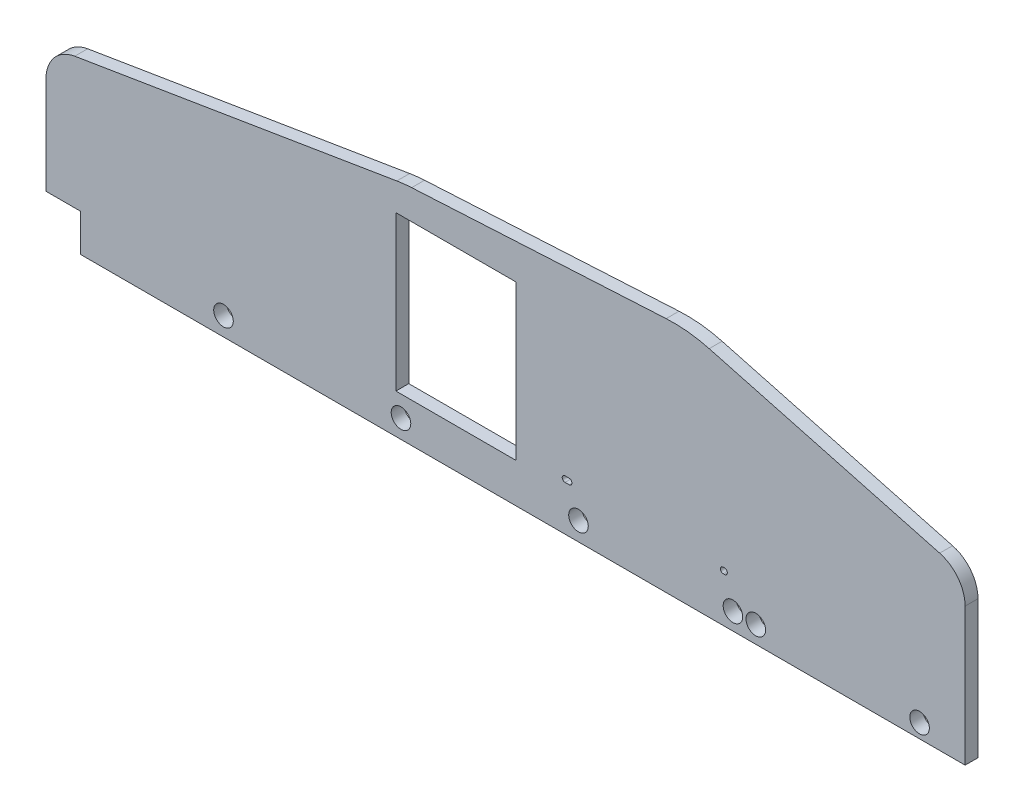
ISO-10303-21;
HEADER;
FILE_DESCRIPTION(('STEP AP214'),'2;1');
FILE_NAME('part.step','',(''),(''),'','','');
FILE_SCHEMA(('AUTOMOTIVE_DESIGN { 1 0 10303 214 1 1 1 1 }'));
ENDSEC;
DATA;
#1=APPLICATION_CONTEXT('core data for automotive mechanical design processes');
#2=APPLICATION_PROTOCOL_DEFINITION('international standard','automotive_design',2000,#1);
#3=PRODUCT_CONTEXT('',#1,'mechanical');
#4=PRODUCT('Part','Part','',(#3));
#5=PRODUCT_RELATED_PRODUCT_CATEGORY('part','',(#4));
#6=PRODUCT_DEFINITION_FORMATION('','',#4);
#7=PRODUCT_DEFINITION_CONTEXT('part definition',#1,'design');
#8=PRODUCT_DEFINITION('design','',#6,#7);
#9=PRODUCT_DEFINITION_SHAPE('','',#8);
#10=(LENGTH_UNIT() NAMED_UNIT(*) SI_UNIT(.MILLI.,.METRE.));
#11=(NAMED_UNIT(*) PLANE_ANGLE_UNIT() SI_UNIT($,.RADIAN.));
#12=(NAMED_UNIT(*) SI_UNIT($,.STERADIAN.) SOLID_ANGLE_UNIT());
#13=UNCERTAINTY_MEASURE_WITH_UNIT(LENGTH_MEASURE(1.E-05),#10,'distance_accuracy_value','');
#14=(GEOMETRIC_REPRESENTATION_CONTEXT(3) GLOBAL_UNCERTAINTY_ASSIGNED_CONTEXT((#13)) GLOBAL_UNIT_ASSIGNED_CONTEXT((#10,
#11,#12)) REPRESENTATION_CONTEXT('',''));
#15=CARTESIAN_POINT('',(0.,0.,0.));
#16=DIRECTION('',(0.,0.,1.));
#17=DIRECTION('',(1.,0.,0.));
#18=AXIS2_PLACEMENT_3D('',#15,#16,#17);
#19=CARTESIAN_POINT('',(0.,0.,4.7625));
#20=DIRECTION('',(0.,0.,1.));
#21=DIRECTION('',(1.,0.,0.));
#22=AXIS2_PLACEMENT_3D('',#19,#20,#21);
#23=PLANE('',#22);
#24=CARTESIAN_POINT('',(46.9999999999997,35.3,4.7625));
#25=DIRECTION('',(0.,0.,1.));
#26=DIRECTION('',(1.,0.,0.));
#27=AXIS2_PLACEMENT_3D('',#24,#25,#26);
#28=CIRCLE('',#27,2.09999999999998);
#29=CARTESIAN_POINT('',(46.9999999999997,33.2,4.7625));
#30=VERTEX_POINT('',#29);
#31=CARTESIAN_POINT('',(46.9999999999997,37.3999999999999,4.7625));
#32=VERTEX_POINT('',#31);
#33=EDGE_CURVE('E50',#30,#32,#28,.T.);
#34=ORIENTED_EDGE('',*,*,#33,.F.);
#35=DIRECTION('',(1.,0.,0.));
#36=VECTOR('',#35,1.);
#37=CARTESIAN_POINT('',(46.9999999999997,33.2,4.7625));
#38=LINE('',#37,#36);
#39=CARTESIAN_POINT('',(43.9999999999997,33.2,4.7625));
#40=VERTEX_POINT('',#39);
#41=EDGE_CURVE('E213',#40,#30,#38,.T.);
#42=ORIENTED_EDGE('',*,*,#41,.F.);
#43=CARTESIAN_POINT('',(43.9999999999997,35.3,4.7625));
#44=DIRECTION('',(0.,0.,1.));
#45=DIRECTION('',(1.,0.,0.));
#46=AXIS2_PLACEMENT_3D('',#43,#44,#45);
#47=CIRCLE('',#46,2.09999999999998);
#48=CARTESIAN_POINT('',(43.9999999999997,37.3999999999999,4.7625));
#49=VERTEX_POINT('',#48);
#50=EDGE_CURVE('E216',#49,#40,#47,.T.);
#51=ORIENTED_EDGE('',*,*,#50,.F.);
#52=DIRECTION('',(-1.,0.,0.));
#53=VECTOR('',#52,1.);
#54=CARTESIAN_POINT('',(46.9999999999997,37.3999999999999,4.7625));
#55=LINE('',#54,#53);
#56=EDGE_CURVE('E222',#32,#49,#55,.T.);
#57=ORIENTED_EDGE('',*,*,#56,.F.);
#58=EDGE_LOOP('',(#34,#42,#51,#57));
#59=FACE_BOUND('',#58,.T.);
#60=CARTESIAN_POINT('',(161.,35.3,4.7625));
#61=DIRECTION('',(0.,0.,1.));
#62=DIRECTION('',(1.,0.,0.));
#63=AXIS2_PLACEMENT_3D('',#60,#61,#62);
#64=CIRCLE('',#63,2.1);
#65=CARTESIAN_POINT('',(161.,37.4,4.7625));
#66=VERTEX_POINT('',#65);
#67=CARTESIAN_POINT('',(161.,33.2,4.7625));
#68=VERTEX_POINT('',#67);
#69=EDGE_CURVE('E228',#66,#68,#64,.T.);
#70=ORIENTED_EDGE('',*,*,#69,.F.);
#71=DIRECTION('',(-1.,0.,0.));
#72=VECTOR('',#71,1.);
#73=CARTESIAN_POINT('',(161.,37.4,4.7625));
#74=LINE('',#73,#72);
#75=CARTESIAN_POINT('',(162.,37.4,4.7625));
#76=VERTEX_POINT('',#75);
#77=EDGE_CURVE('E236',#76,#66,#74,.T.);
#78=ORIENTED_EDGE('',*,*,#77,.F.);
#79=CARTESIAN_POINT('',(162.,35.3,4.7625));
#80=DIRECTION('',(0.,0.,1.));
#81=DIRECTION('',(1.,0.,0.));
#82=AXIS2_PLACEMENT_3D('',#79,#80,#81);
#83=CIRCLE('',#82,2.1);
#84=CARTESIAN_POINT('',(162.,33.2,4.7625));
#85=VERTEX_POINT('',#84);
#86=EDGE_CURVE('E250',#85,#76,#83,.T.);
#87=ORIENTED_EDGE('',*,*,#86,.F.);
#88=DIRECTION('',(1.,0.,0.));
#89=VECTOR('',#88,1.);
#90=CARTESIAN_POINT('',(161.,33.2,4.7625));
#91=LINE('',#90,#89);
#92=EDGE_CURVE('E247',#68,#85,#91,.T.);
#93=ORIENTED_EDGE('',*,*,#92,.F.);
#94=EDGE_LOOP('',(#70,#78,#87,#93));
#95=FACE_BOUND('',#94,.T.);
#96=DIRECTION('',(0.,1.,0.));
#97=VECTOR('',#96,1.);
#98=CARTESIAN_POINT('',(7.78151433000002,29.1464999993336,4.7625));
#99=LINE('',#98,#97);
#100=CARTESIAN_POINT('',(7.78151433000002,29.1464999993336,4.7625));
#101=VERTEX_POINT('',#100);
#102=CARTESIAN_POINT('',(7.78151433000002,143.446499999334,4.7625));
#103=VERTEX_POINT('',#102);
#104=EDGE_CURVE('E257',#101,#103,#99,.T.);
#105=ORIENTED_EDGE('',*,*,#104,.F.);
#106=DIRECTION('',(1.,0.,0.));
#107=VECTOR('',#106,1.);
#108=CARTESIAN_POINT('',(-81.1184856700001,29.1464999993336,4.7625));
#109=LINE('',#108,#107);
#110=CARTESIAN_POINT('',(-81.1184856700001,29.1464999993336,4.7625));
#111=VERTEX_POINT('',#110);
#112=EDGE_CURVE('E268',#111,#101,#109,.T.);
#113=ORIENTED_EDGE('',*,*,#112,.F.);
#114=DIRECTION('',(0.,-1.,0.));
#115=VECTOR('',#114,1.);
#116=CARTESIAN_POINT('',(-81.1184856700001,29.1464999993336,4.7625));
#117=LINE('',#116,#115);
#118=CARTESIAN_POINT('',(-81.1184856700001,143.446499999334,4.7625));
#119=VERTEX_POINT('',#118);
#120=EDGE_CURVE('E282',#119,#111,#117,.T.);
#121=ORIENTED_EDGE('',*,*,#120,.F.);
#122=DIRECTION('',(-1.,0.,0.));
#123=VECTOR('',#122,1.);
#124=CARTESIAN_POINT('',(7.78151433000002,143.446499999334,4.7625));
#125=LINE('',#124,#123);
#126=EDGE_CURVE('E279',#103,#119,#125,.T.);
#127=ORIENTED_EDGE('',*,*,#126,.F.);
#128=EDGE_LOOP('',(#105,#113,#121,#127));
#129=FACE_BOUND('',#128,.T.);
#130=DIRECTION('',(-1.,0.,0.));
#131=VECTOR('',#130,1.);
#132=CARTESIAN_POINT('',(-340.,27.686,4.7625));
#133=LINE('',#132,#131);
#134=CARTESIAN_POINT('',(-314.6,27.686,4.7625));
#135=VERTEX_POINT('',#134);
#136=CARTESIAN_POINT('',(-340.,27.686,4.7625));
#137=VERTEX_POINT('',#136);
#138=EDGE_CURVE('E300',#135,#137,#133,.T.);
#139=ORIENTED_EDGE('',*,*,#138,.F.);
#140=DIRECTION('',(0.,1.,0.));
#141=VECTOR('',#140,1.);
#142=CARTESIAN_POINT('',(-314.6,0.,4.7625));
#143=LINE('',#142,#141);
#144=CARTESIAN_POINT('',(-314.6,0.,4.7625));
#145=VERTEX_POINT('',#144);
#146=EDGE_CURVE('E289',#145,#135,#143,.T.);
#147=ORIENTED_EDGE('',*,*,#146,.F.);
#148=DIRECTION('',(1.,0.,0.));
#149=VECTOR('',#148,1.);
#150=CARTESIAN_POINT('',(340.,0.,4.7625));
#151=LINE('',#150,#149);
#152=CARTESIAN_POINT('',(340.,0.,4.7625));
#153=VERTEX_POINT('',#152);
#154=EDGE_CURVE('E353',#145,#153,#151,.T.);
#155=ORIENTED_EDGE('',*,*,#154,.T.);
#156=DIRECTION('',(0.,1.,0.));
#157=VECTOR('',#156,1.);
#158=CARTESIAN_POINT('',(340.,26.4000000319999,4.7625));
#159=LINE('',#158,#157);
#160=CARTESIAN_POINT('',(340.,101.916359737829,4.7625));
#161=VERTEX_POINT('',#160);
#162=EDGE_CURVE('E356',#153,#161,#159,.T.);
#163=ORIENTED_EDGE('',*,*,#162,.T.);
#164=CARTESIAN_POINT('',(314.6,101.916359737829,4.7625));
#165=DIRECTION('',(0.,0.,1.));
#166=DIRECTION('',(1.,0.,0.));
#167=AXIS2_PLACEMENT_3D('',#164,#165,#166);
#168=CIRCLE('',#167,25.4);
#169=CARTESIAN_POINT('',(321.181865578619,126.44876780359,4.7625));
#170=VERTEX_POINT('',#169);
#171=EDGE_CURVE('E395',#161,#170,#168,.T.);
#172=ORIENTED_EDGE('',*,*,#171,.T.);
#173=DIRECTION('',(-0.965842837234668,0.25912856608735,0.));
#174=VECTOR('',#173,1.);
#175=CARTESIAN_POINT('',(135.,176.400000032,4.7625));
#176=LINE('',#175,#174);
#177=CARTESIAN_POINT('',(150.652527384487,172.20054146543,4.7625));
#178=VERTEX_POINT('',#177);
#179=EDGE_CURVE('E359',#170,#178,#176,.T.);
#180=ORIENTED_EDGE('',*,*,#179,.T.);
#181=CARTESIAN_POINT('',(124.325065070013,74.0709092023878,4.7625));
#182=DIRECTION('',(0.,0.,1.));
#183=DIRECTION('',(1.,0.,0.));
#184=AXIS2_PLACEMENT_3D('',#181,#182,#183);
#185=CIRCLE('',#184,101.6);
#186=CARTESIAN_POINT('',(118.817745380408,175.521534778756,4.7625));
#187=VERTEX_POINT('',#186);
#188=EDGE_CURVE('E416',#178,#187,#185,.T.);
#189=ORIENTED_EDGE('',*,*,#188,.T.);
#190=DIRECTION('',(-0.998529779294965,-0.0542059024567401,0.));
#191=VECTOR('',#190,1.);
#192=CARTESIAN_POINT('',(135.,176.400000032,4.7625));
#193=LINE('',#192,#191);
#194=CARTESIAN_POINT('',(-69.4738595727648,165.299990481178,4.7625));
#195=VERTEX_POINT('',#194);
#196=EDGE_CURVE('E362',#187,#195,#193,.T.);
#197=ORIENTED_EDGE('',*,*,#196,.T.);
#198=CARTESIAN_POINT('',(-63.9665398831599,63.8493649048094,4.7625));
#199=DIRECTION('',(0.,0.,1.));
#200=DIRECTION('',(1.,0.,0.));
#201=AXIS2_PLACEMENT_3D('',#198,#199,#200);
#202=CIRCLE('',#201,101.6);
#203=CARTESIAN_POINT('',(-80.4608590352519,164.101534136746,4.7625));
#204=VERTEX_POINT('',#203);
#205=EDGE_CURVE('E43',#195,#204,#202,.T.);
#206=ORIENTED_EDGE('',*,*,#205,.T.);
#207=DIRECTION('',(-0.986733949133238,-0.162345660945788,0.));
#208=VECTOR('',#207,1.);
#209=CARTESIAN_POINT('',(-75.,165.,4.7625));
#210=LINE('',#209,#208);
#211=CARTESIAN_POINT('',(-318.723579788023,124.900573317137,4.7625));
#212=VERTEX_POINT('',#211);
#213=EDGE_CURVE('E365',#204,#212,#210,.T.);
#214=ORIENTED_EDGE('',*,*,#213,.T.);
#215=CARTESIAN_POINT('',(-314.6,99.8375310091529,4.7625));
#216=DIRECTION('',(0.,0.,1.));
#217=DIRECTION('',(1.,0.,0.));
#218=AXIS2_PLACEMENT_3D('',#215,#216,#217);
#219=CIRCLE('',#218,25.4);
#220=CARTESIAN_POINT('',(-340.,99.8375310091529,4.7625));
#221=VERTEX_POINT('',#220);
#222=EDGE_CURVE('E397',#212,#221,#219,.T.);
#223=ORIENTED_EDGE('',*,*,#222,.T.);
#224=DIRECTION('',(0.,-1.,0.));
#225=VECTOR('',#224,1.);
#226=CARTESIAN_POINT('',(-340.,0.,4.7625));
#227=LINE('',#226,#225);
#228=EDGE_CURVE('E350',#221,#137,#227,.T.);
#229=ORIENTED_EDGE('',*,*,#228,.T.);
#230=EDGE_LOOP('',(#139,#147,#155,#163,#172,#180,#189,#197,#206,#214,#223,#229));
#231=FACE_BOUND('',#230,.T.);
#232=CARTESIAN_POINT('',(306.284699107242,10.414,4.7625));
#233=DIRECTION('',(0.,0.,1.));
#234=DIRECTION('',(1.,0.,0.));
#235=AXIS2_PLACEMENT_3D('',#232,#233,#234);
#236=CIRCLE('',#235,7.23899999999998);
#237=CARTESIAN_POINT('',(313.523699107242,10.414,4.7625));
#238=VERTEX_POINT('',#237);
#239=EDGE_CURVE('E320',#238,#238,#236,.T.);
#240=ORIENTED_EDGE('',*,*,#239,.F.);
#241=EDGE_LOOP('',(#240));
#242=FACE_BOUND('',#241,.T.);
#243=CARTESIAN_POINT('',(53.9539999999999,13.7000000319999,4.7625));
#244=DIRECTION('',(0.,0.,1.));
#245=DIRECTION('',(1.,0.,0.));
#246=AXIS2_PLACEMENT_3D('',#243,#244,#245);
#247=CIRCLE('',#246,7.239);
#248=CARTESIAN_POINT('',(61.1929999999999,13.7000000319999,4.7625));
#249=VERTEX_POINT('',#248);
#250=EDGE_CURVE('E332',#249,#249,#247,.T.);
#251=ORIENTED_EDGE('',*,*,#250,.F.);
#252=EDGE_LOOP('',(#251));
#253=FACE_BOUND('',#252,.T.);
#254=CARTESIAN_POINT('',(-77.364,13.7000000319999,4.7625));
#255=DIRECTION('',(0.,0.,1.));
#256=DIRECTION('',(1.,0.,0.));
#257=AXIS2_PLACEMENT_3D('',#254,#255,#256);
#258=CIRCLE('',#257,7.239);
#259=CARTESIAN_POINT('',(-70.125,13.7000000319999,4.7625));
#260=VERTEX_POINT('',#259);
#261=EDGE_CURVE('E344',#260,#260,#258,.T.);
#262=ORIENTED_EDGE('',*,*,#261,.F.);
#263=EDGE_LOOP('',(#262));
#264=FACE_BOUND('',#263,.T.);
#265=CARTESIAN_POINT('',(-208.682,13.7000000319999,4.7625));
#266=DIRECTION('',(0.,0.,1.));
#267=DIRECTION('',(1.,0.,0.));
#268=AXIS2_PLACEMENT_3D('',#265,#266,#267);
#269=CIRCLE('',#268,7.23899999999998);
#270=CARTESIAN_POINT('',(-201.443,13.7000000319999,4.7625));
#271=VERTEX_POINT('',#270);
#272=EDGE_CURVE('E338',#271,#271,#269,.T.);
#273=ORIENTED_EDGE('',*,*,#272,.F.);
#274=EDGE_LOOP('',(#273));
#275=FACE_BOUND('',#274,.T.);
#276=CARTESIAN_POINT('',(185.126699107242,12.7,4.7625));
#277=DIRECTION('',(0.,0.,1.));
#278=DIRECTION('',(1.,0.,0.));
#279=AXIS2_PLACEMENT_3D('',#276,#277,#278);
#280=CIRCLE('',#279,7.23899999999998);
#281=CARTESIAN_POINT('',(192.365699107242,12.7,4.7625));
#282=VERTEX_POINT('',#281);
#283=EDGE_CURVE('E326',#282,#282,#280,.T.);
#284=ORIENTED_EDGE('',*,*,#283,.F.);
#285=EDGE_LOOP('',(#284));
#286=FACE_BOUND('',#285,.T.);
#287=CARTESIAN_POINT('',(168.225103231645,12.7,4.7625));
#288=DIRECTION('',(0.,0.,1.));
#289=DIRECTION('',(1.,0.,0.));
#290=AXIS2_PLACEMENT_3D('',#287,#288,#289);
#291=CIRCLE('',#290,7.23899999999998);
#292=CARTESIAN_POINT('',(175.464103231645,12.7,4.7625));
#293=VERTEX_POINT('',#292);
#294=EDGE_CURVE('E314',#293,#293,#291,.T.);
#295=ORIENTED_EDGE('',*,*,#294,.F.);
#296=EDGE_LOOP('',(#295));
#297=FACE_BOUND('',#296,.T.);
#298=ADVANCED_FACE('F35',(#59,#95,#129,#231,#242,#253,#264,#275,#286,#297),#23,.T.);
#299=CARTESIAN_POINT('',(0.,0.,-4.7625));
#300=DIRECTION('',(0.,0.,1.));
#301=DIRECTION('',(1.,0.,0.));
#302=AXIS2_PLACEMENT_3D('',#299,#300,#301);
#303=PLANE('',#302);
#304=DIRECTION('',(1.,0.,0.));
#305=VECTOR('',#304,1.);
#306=CARTESIAN_POINT('',(46.9999999999997,33.2,-4.7625));
#307=LINE('',#306,#305);
#308=CARTESIAN_POINT('',(43.9999999999997,33.2,-4.7625));
#309=VERTEX_POINT('',#308);
#310=CARTESIAN_POINT('',(46.9999999999997,33.2,-4.7625));
#311=VERTEX_POINT('',#310);
#312=EDGE_CURVE('E203',#309,#311,#307,.T.);
#313=ORIENTED_EDGE('',*,*,#312,.T.);
#314=CARTESIAN_POINT('',(46.9999999999997,35.3,-4.7625));
#315=DIRECTION('',(0.,0.,1.));
#316=DIRECTION('',(1.,0.,0.));
#317=AXIS2_PLACEMENT_3D('',#314,#315,#316);
#318=CIRCLE('',#317,2.09999999999998);
#319=CARTESIAN_POINT('',(46.9999999999997,37.3999999999999,-4.7625));
#320=VERTEX_POINT('',#319);
#321=EDGE_CURVE('E197',#311,#320,#318,.T.);
#322=ORIENTED_EDGE('',*,*,#321,.T.);
#323=DIRECTION('',(-1.,0.,0.));
#324=VECTOR('',#323,1.);
#325=CARTESIAN_POINT('',(46.9999999999997,37.3999999999999,-4.7625));
#326=LINE('',#325,#324);
#327=CARTESIAN_POINT('',(43.9999999999997,37.3999999999999,-4.7625));
#328=VERTEX_POINT('',#327);
#329=EDGE_CURVE('E206',#320,#328,#326,.T.);
#330=ORIENTED_EDGE('',*,*,#329,.T.);
#331=CARTESIAN_POINT('',(43.9999999999997,35.3,-4.7625));
#332=DIRECTION('',(0.,0.,1.));
#333=DIRECTION('',(1.,0.,0.));
#334=AXIS2_PLACEMENT_3D('',#331,#332,#333);
#335=CIRCLE('',#334,2.09999999999998);
#336=EDGE_CURVE('E58',#328,#309,#335,.T.);
#337=ORIENTED_EDGE('',*,*,#336,.T.);
#338=EDGE_LOOP('',(#313,#322,#330,#337));
#339=FACE_BOUND('',#338,.T.);
#340=DIRECTION('',(-1.,0.,0.));
#341=VECTOR('',#340,1.);
#342=CARTESIAN_POINT('',(161.,37.4,-4.7625));
#343=LINE('',#342,#341);
#344=CARTESIAN_POINT('',(162.,37.4,-4.7625));
#345=VERTEX_POINT('',#344);
#346=CARTESIAN_POINT('',(161.,37.4,-4.7625));
#347=VERTEX_POINT('',#346);
#348=EDGE_CURVE('E242',#345,#347,#343,.T.);
#349=ORIENTED_EDGE('',*,*,#348,.T.);
#350=CARTESIAN_POINT('',(161.,35.3,-4.7625));
#351=DIRECTION('',(0.,0.,1.));
#352=DIRECTION('',(1.,0.,0.));
#353=AXIS2_PLACEMENT_3D('',#350,#351,#352);
#354=CIRCLE('',#353,2.1);
#355=CARTESIAN_POINT('',(161.,33.2,-4.7625));
#356=VERTEX_POINT('',#355);
#357=EDGE_CURVE('E232',#347,#356,#354,.T.);
#358=ORIENTED_EDGE('',*,*,#357,.T.);
#359=DIRECTION('',(1.,0.,0.));
#360=VECTOR('',#359,1.);
#361=CARTESIAN_POINT('',(161.,33.2,-4.7625));
#362=LINE('',#361,#360);
#363=CARTESIAN_POINT('',(162.,33.2,-4.7625));
#364=VERTEX_POINT('',#363);
#365=EDGE_CURVE('E235',#356,#364,#362,.T.);
#366=ORIENTED_EDGE('',*,*,#365,.T.);
#367=CARTESIAN_POINT('',(162.,35.3,-4.7625));
#368=DIRECTION('',(0.,0.,1.));
#369=DIRECTION('',(1.,0.,0.));
#370=AXIS2_PLACEMENT_3D('',#367,#368,#369);
#371=CIRCLE('',#370,2.1);
#372=EDGE_CURVE('E239',#364,#345,#371,.T.);
#373=ORIENTED_EDGE('',*,*,#372,.T.);
#374=EDGE_LOOP('',(#349,#358,#366,#373));
#375=FACE_BOUND('',#374,.T.);
#376=DIRECTION('',(1.,0.,0.));
#377=VECTOR('',#376,1.);
#378=CARTESIAN_POINT('',(-81.1184856700001,29.1464999993336,-4.7625));
#379=LINE('',#378,#377);
#380=CARTESIAN_POINT('',(-81.1184856700001,29.1464999993336,-4.7625));
#381=VERTEX_POINT('',#380);
#382=CARTESIAN_POINT('',(7.78151433000002,29.1464999993336,-4.7625));
#383=VERTEX_POINT('',#382);
#384=EDGE_CURVE('E274',#381,#383,#379,.T.);
#385=ORIENTED_EDGE('',*,*,#384,.T.);
#386=DIRECTION('',(0.,1.,0.));
#387=VECTOR('',#386,1.);
#388=CARTESIAN_POINT('',(7.78151433000002,29.1464999993336,-4.7625));
#389=LINE('',#388,#387);
#390=CARTESIAN_POINT('',(7.78151433000002,143.446499999334,-4.7625));
#391=VERTEX_POINT('',#390);
#392=EDGE_CURVE('E264',#383,#391,#389,.T.);
#393=ORIENTED_EDGE('',*,*,#392,.T.);
#394=DIRECTION('',(-1.,0.,0.));
#395=VECTOR('',#394,1.);
#396=CARTESIAN_POINT('',(7.78151433000002,143.446499999334,-4.7625));
#397=LINE('',#396,#395);
#398=CARTESIAN_POINT('',(-81.1184856700001,143.446499999334,-4.7625));
#399=VERTEX_POINT('',#398);
#400=EDGE_CURVE('E267',#391,#399,#397,.T.);
#401=ORIENTED_EDGE('',*,*,#400,.T.);
#402=DIRECTION('',(0.,-1.,0.));
#403=VECTOR('',#402,1.);
#404=CARTESIAN_POINT('',(-81.1184856700001,29.1464999993336,-4.7625));
#405=LINE('',#404,#403);
#406=EDGE_CURVE('E271',#399,#381,#405,.T.);
#407=ORIENTED_EDGE('',*,*,#406,.T.);
#408=EDGE_LOOP('',(#385,#393,#401,#407));
#409=FACE_BOUND('',#408,.T.);
#410=DIRECTION('',(0.,1.,0.));
#411=VECTOR('',#410,1.);
#412=CARTESIAN_POINT('',(-314.6,0.,-4.7625));
#413=LINE('',#412,#411);
#414=CARTESIAN_POINT('',(-314.6,0.,-4.7625));
#415=VERTEX_POINT('',#414);
#416=CARTESIAN_POINT('',(-314.6,27.686,-4.7625));
#417=VERTEX_POINT('',#416);
#418=EDGE_CURVE('E296',#415,#417,#413,.T.);
#419=ORIENTED_EDGE('',*,*,#418,.T.);
#420=DIRECTION('',(-1.,0.,0.));
#421=VECTOR('',#420,1.);
#422=CARTESIAN_POINT('',(-340.,27.686,-4.7625));
#423=LINE('',#422,#421);
#424=CARTESIAN_POINT('',(-340.,27.686,-4.7625));
#425=VERTEX_POINT('',#424);
#426=EDGE_CURVE('E299',#417,#425,#423,.T.);
#427=ORIENTED_EDGE('',*,*,#426,.T.);
#428=DIRECTION('',(0.,-1.,0.));
#429=VECTOR('',#428,1.);
#430=CARTESIAN_POINT('',(-340.,26.4000000319999,-4.7625));
#431=LINE('',#430,#429);
#432=CARTESIAN_POINT('',(-340.,99.8375310091529,-4.7625));
#433=VERTEX_POINT('',#432);
#434=EDGE_CURVE('E354',#433,#425,#431,.T.);
#435=ORIENTED_EDGE('',*,*,#434,.F.);
#436=CARTESIAN_POINT('',(-314.6,99.8375310091529,-4.7625));
#437=DIRECTION('',(0.,0.,1.));
#438=DIRECTION('',(1.,0.,0.));
#439=AXIS2_PLACEMENT_3D('',#436,#437,#438);
#440=CIRCLE('',#439,25.4);
#441=CARTESIAN_POINT('',(-318.723579788023,124.900573317137,-4.7625));
#442=VERTEX_POINT('',#441);
#443=EDGE_CURVE('E389',#433,#442,#440,.F.);
#444=ORIENTED_EDGE('',*,*,#443,.T.);
#445=DIRECTION('',(-0.986733949133238,-0.162345660945788,0.));
#446=VECTOR('',#445,1.);
#447=CARTESIAN_POINT('',(-75.,165.,-4.7625));
#448=LINE('',#447,#446);
#449=CARTESIAN_POINT('',(-80.4608590352519,164.101534136746,-4.7625));
#450=VERTEX_POINT('',#449);
#451=EDGE_CURVE('E378',#450,#442,#448,.T.);
#452=ORIENTED_EDGE('',*,*,#451,.F.);
#453=CARTESIAN_POINT('',(-63.9665398831599,63.8493649048094,-4.7625));
#454=DIRECTION('',(0.,0.,1.));
#455=DIRECTION('',(1.,0.,0.));
#456=AXIS2_PLACEMENT_3D('',#453,#454,#455);
#457=CIRCLE('',#456,101.6);
#458=CARTESIAN_POINT('',(-69.4738595727648,165.299990481178,-4.7625));
#459=VERTEX_POINT('',#458);
#460=EDGE_CURVE('E409',#450,#459,#457,.F.);
#461=ORIENTED_EDGE('',*,*,#460,.T.);
#462=DIRECTION('',(-0.998529779294965,-0.0542059024567401,0.));
#463=VECTOR('',#462,1.);
#464=CARTESIAN_POINT('',(135.,176.400000032,-4.7625));
#465=LINE('',#464,#463);
#466=CARTESIAN_POINT('',(118.817745380408,175.521534778756,-4.7625));
#467=VERTEX_POINT('',#466);
#468=EDGE_CURVE('E375',#467,#459,#465,.T.);
#469=ORIENTED_EDGE('',*,*,#468,.F.);
#470=CARTESIAN_POINT('',(124.325065070013,74.0709092023878,-4.7625));
#471=DIRECTION('',(0.,0.,1.));
#472=DIRECTION('',(1.,0.,0.));
#473=AXIS2_PLACEMENT_3D('',#470,#471,#472);
#474=CIRCLE('',#473,101.6);
#475=CARTESIAN_POINT('',(150.652527384487,172.20054146543,-4.7625));
#476=VERTEX_POINT('',#475);
#477=EDGE_CURVE('E407',#467,#476,#474,.F.);
#478=ORIENTED_EDGE('',*,*,#477,.T.);
#479=DIRECTION('',(-0.965842837234668,0.25912856608735,0.));
#480=VECTOR('',#479,1.);
#481=CARTESIAN_POINT('',(135.,176.400000032,-4.7625));
#482=LINE('',#481,#480);
#483=CARTESIAN_POINT('',(321.181865578619,126.44876780359,-4.7625));
#484=VERTEX_POINT('',#483);
#485=EDGE_CURVE('E372',#484,#476,#482,.T.);
#486=ORIENTED_EDGE('',*,*,#485,.F.);
#487=CARTESIAN_POINT('',(314.6,101.916359737829,-4.7625));
#488=DIRECTION('',(0.,0.,1.));
#489=DIRECTION('',(1.,0.,0.));
#490=AXIS2_PLACEMENT_3D('',#487,#488,#489);
#491=CIRCLE('',#490,25.4);
#492=CARTESIAN_POINT('',(340.,101.916359737829,-4.7625));
#493=VERTEX_POINT('',#492);
#494=EDGE_CURVE('E387',#484,#493,#491,.F.);
#495=ORIENTED_EDGE('',*,*,#494,.T.);
#496=DIRECTION('',(0.,1.,0.));
#497=VECTOR('',#496,1.);
#498=CARTESIAN_POINT('',(340.,121.400000032,-4.7625));
#499=LINE('',#498,#497);
#500=CARTESIAN_POINT('',(340.,0.,-4.7625));
#501=VERTEX_POINT('',#500);
#502=EDGE_CURVE('E369',#501,#493,#499,.T.);
#503=ORIENTED_EDGE('',*,*,#502,.F.);
#504=DIRECTION('',(1.,0.,0.));
#505=VECTOR('',#504,1.);
#506=CARTESIAN_POINT('',(340.,0.,-4.7625));
#507=LINE('',#506,#505);
#508=EDGE_CURVE('E347',#415,#501,#507,.T.);
#509=ORIENTED_EDGE('',*,*,#508,.F.);
#510=EDGE_LOOP('',(#419,#427,#435,#444,#452,#461,#469,#478,#486,#495,#503,#509));
#511=FACE_BOUND('',#510,.T.);
#512=CARTESIAN_POINT('',(-77.364,13.7000000319999,-4.7625));
#513=DIRECTION('',(0.,0.,1.));
#514=DIRECTION('',(1.,0.,0.));
#515=AXIS2_PLACEMENT_3D('',#512,#513,#514);
#516=CIRCLE('',#515,7.239);
#517=CARTESIAN_POINT('',(-70.125,13.7000000319999,-4.7625));
#518=VERTEX_POINT('',#517);
#519=EDGE_CURVE('E341',#518,#518,#516,.T.);
#520=ORIENTED_EDGE('',*,*,#519,.T.);
#521=EDGE_LOOP('',(#520));
#522=FACE_BOUND('',#521,.T.);
#523=CARTESIAN_POINT('',(-208.682,13.7000000319999,-4.7625));
#524=DIRECTION('',(0.,0.,1.));
#525=DIRECTION('',(1.,0.,0.));
#526=AXIS2_PLACEMENT_3D('',#523,#524,#525);
#527=CIRCLE('',#526,7.23899999999998);
#528=CARTESIAN_POINT('',(-201.443,13.7000000319999,-4.7625));
#529=VERTEX_POINT('',#528);
#530=EDGE_CURVE('E335',#529,#529,#527,.T.);
#531=ORIENTED_EDGE('',*,*,#530,.T.);
#532=EDGE_LOOP('',(#531));
#533=FACE_BOUND('',#532,.T.);
#534=CARTESIAN_POINT('',(53.9539999999999,13.7000000319999,-4.7625));
#535=DIRECTION('',(0.,0.,1.));
#536=DIRECTION('',(1.,0.,0.));
#537=AXIS2_PLACEMENT_3D('',#534,#535,#536);
#538=CIRCLE('',#537,7.239);
#539=CARTESIAN_POINT('',(61.1929999999999,13.7000000319999,-4.7625));
#540=VERTEX_POINT('',#539);
#541=EDGE_CURVE('E329',#540,#540,#538,.T.);
#542=ORIENTED_EDGE('',*,*,#541,.T.);
#543=EDGE_LOOP('',(#542));
#544=FACE_BOUND('',#543,.T.);
#545=CARTESIAN_POINT('',(185.126699107242,12.7,-4.7625));
#546=DIRECTION('',(0.,0.,1.));
#547=DIRECTION('',(1.,0.,0.));
#548=AXIS2_PLACEMENT_3D('',#545,#546,#547);
#549=CIRCLE('',#548,7.23899999999998);
#550=CARTESIAN_POINT('',(192.365699107242,12.7,-4.7625));
#551=VERTEX_POINT('',#550);
#552=EDGE_CURVE('E323',#551,#551,#549,.T.);
#553=ORIENTED_EDGE('',*,*,#552,.T.);
#554=EDGE_LOOP('',(#553));
#555=FACE_BOUND('',#554,.T.);
#556=CARTESIAN_POINT('',(306.284699107242,10.414,-4.7625));
#557=DIRECTION('',(0.,0.,1.));
#558=DIRECTION('',(1.,0.,0.));
#559=AXIS2_PLACEMENT_3D('',#556,#557,#558);
#560=CIRCLE('',#559,7.23899999999998);
#561=CARTESIAN_POINT('',(313.523699107242,10.414,-4.7625));
#562=VERTEX_POINT('',#561);
#563=EDGE_CURVE('E317',#562,#562,#560,.T.);
#564=ORIENTED_EDGE('',*,*,#563,.T.);
#565=EDGE_LOOP('',(#564));
#566=FACE_BOUND('',#565,.T.);
#567=CARTESIAN_POINT('',(168.225103231645,12.7,-4.7625));
#568=DIRECTION('',(0.,0.,1.));
#569=DIRECTION('',(1.,0.,0.));
#570=AXIS2_PLACEMENT_3D('',#567,#568,#569);
#571=CIRCLE('',#570,7.23899999999998);
#572=CARTESIAN_POINT('',(175.464103231645,12.7,-4.7625));
#573=VERTEX_POINT('',#572);
#574=EDGE_CURVE('E310',#573,#573,#571,.T.);
#575=ORIENTED_EDGE('',*,*,#574,.T.);
#576=EDGE_LOOP('',(#575));
#577=FACE_BOUND('',#576,.T.);
#578=ADVANCED_FACE('F210',(#339,#375,#409,#511,#522,#533,#544,#555,#566,#577),#303,.F.);
#579=CARTESIAN_POINT('',(340.,0.,4.7625));
#580=DIRECTION('',(0.,1.,0.));
#581=DIRECTION('',(0.,0.,1.));
#582=AXIS2_PLACEMENT_3D('',#579,#580,#581);
#583=PLANE('',#582);
#584=ORIENTED_EDGE('',*,*,#154,.F.);
#585=DIRECTION('',(0.,0.,1.));
#586=VECTOR('',#585,1.);
#587=CARTESIAN_POINT('',(-314.6,0.,-4.7625));
#588=LINE('',#587,#586);
#589=EDGE_CURVE('E303',#415,#145,#588,.T.);
#590=ORIENTED_EDGE('',*,*,#589,.F.);
#591=ORIENTED_EDGE('',*,*,#508,.T.);
#592=DIRECTION('',(0.,0.,-1.));
#593=VECTOR('',#592,1.);
#594=CARTESIAN_POINT('',(340.,0.,4.7625));
#595=LINE('',#594,#593);
#596=EDGE_CURVE('E367',#153,#501,#595,.T.);
#597=ORIENTED_EDGE('',*,*,#596,.F.);
#598=EDGE_LOOP('',(#584,#590,#591,#597));
#599=FACE_BOUND('',#598,.T.);
#600=ADVANCED_FACE('F458',(#599),#583,.F.);
#601=CARTESIAN_POINT('',(340.,121.400000032,4.7625));
#602=DIRECTION('',(-1.,0.,0.));
#603=DIRECTION('',(0.,-1.,0.));
#604=AXIS2_PLACEMENT_3D('',#601,#602,#603);
#605=PLANE('',#604);
#606=ORIENTED_EDGE('',*,*,#502,.T.);
#607=DIRECTION('',(0.,0.,-1.));
#608=VECTOR('',#607,1.);
#609=CARTESIAN_POINT('',(340.,101.916359737829,4.7625));
#610=LINE('',#609,#608);
#611=EDGE_CURVE('E402',#493,#161,#610,.F.);
#612=ORIENTED_EDGE('',*,*,#611,.T.);
#613=ORIENTED_EDGE('',*,*,#162,.F.);
#614=ORIENTED_EDGE('',*,*,#596,.T.);
#615=EDGE_LOOP('',(#606,#612,#613,#614));
#616=FACE_BOUND('',#615,.T.);
#617=ADVANCED_FACE('F453',(#616),#605,.F.);
#618=CARTESIAN_POINT('',(135.,176.400000032,4.7625));
#619=DIRECTION('',(-0.25912856608735,-0.965842837234668,0.));
#620=DIRECTION('',(0.965842837234668,-0.25912856608735,0.));
#621=AXIS2_PLACEMENT_3D('',#618,#619,#620);
#622=PLANE('',#621);
#623=ORIENTED_EDGE('',*,*,#485,.T.);
#624=DIRECTION('',(0.,0.,-1.));
#625=VECTOR('',#624,1.);
#626=CARTESIAN_POINT('',(150.652527384487,172.20054146543,4.7625));
#627=LINE('',#626,#625);
#628=EDGE_CURVE('E11',#476,#178,#627,.F.);
#629=ORIENTED_EDGE('',*,*,#628,.T.);
#630=ORIENTED_EDGE('',*,*,#179,.F.);
#631=DIRECTION('',(0.,0.,-1.));
#632=VECTOR('',#631,1.);
#633=CARTESIAN_POINT('',(321.181865578619,126.44876780359,4.7625));
#634=LINE('',#633,#632);
#635=EDGE_CURVE('E399',#170,#484,#634,.T.);
#636=ORIENTED_EDGE('',*,*,#635,.T.);
#637=EDGE_LOOP('',(#623,#629,#630,#636));
#638=FACE_BOUND('',#637,.T.);
#639=ADVANCED_FACE('F443',(#638),#622,.F.);
#640=CARTESIAN_POINT('',(135.,176.400000032,4.7625));
#641=DIRECTION('',(0.0542059024567401,-0.998529779294964,0.));
#642=DIRECTION('',(0.998529779294964,0.0542059024567401,0.));
#643=AXIS2_PLACEMENT_3D('',#640,#641,#642);
#644=PLANE('',#643);
#645=ORIENTED_EDGE('',*,*,#468,.T.);
#646=DIRECTION('',(0.,0.,-1.));
#647=VECTOR('',#646,1.);
#648=CARTESIAN_POINT('',(-69.4738595727647,165.299990481178,4.7625));
#649=LINE('',#648,#647);
#650=EDGE_CURVE('E414',#459,#195,#649,.F.);
#651=ORIENTED_EDGE('',*,*,#650,.T.);
#652=ORIENTED_EDGE('',*,*,#196,.F.);
#653=DIRECTION('',(0.,0.,-1.));
#654=VECTOR('',#653,1.);
#655=CARTESIAN_POINT('',(118.817745380408,175.521534778756,4.7625));
#656=LINE('',#655,#654);
#657=EDGE_CURVE('E411',#187,#467,#656,.T.);
#658=ORIENTED_EDGE('',*,*,#657,.T.);
#659=EDGE_LOOP('',(#645,#651,#652,#658));
#660=FACE_BOUND('',#659,.T.);
#661=ADVANCED_FACE('F436',(#660),#644,.F.);
#662=CARTESIAN_POINT('',(-75.,165.,4.7625));
#663=DIRECTION('',(0.162345660945788,-0.986733949133238,0.));
#664=DIRECTION('',(0.986733949133238,0.162345660945788,0.));
#665=AXIS2_PLACEMENT_3D('',#662,#663,#664);
#666=PLANE('',#665);
#667=ORIENTED_EDGE('',*,*,#213,.F.);
#668=DIRECTION('',(0.,0.,-1.));
#669=VECTOR('',#668,1.);
#670=CARTESIAN_POINT('',(-80.4608590352519,164.101534136746,4.7625));
#671=LINE('',#670,#669);
#672=EDGE_CURVE('E404',#204,#450,#671,.T.);
#673=ORIENTED_EDGE('',*,*,#672,.T.);
#674=ORIENTED_EDGE('',*,*,#451,.T.);
#675=DIRECTION('',(0.,0.,-1.));
#676=VECTOR('',#675,1.);
#677=CARTESIAN_POINT('',(-318.723579788023,124.900573317137,4.7625));
#678=LINE('',#677,#676);
#679=EDGE_CURVE('E392',#442,#212,#678,.F.);
#680=ORIENTED_EDGE('',*,*,#679,.T.);
#681=EDGE_LOOP('',(#667,#673,#674,#680));
#682=FACE_BOUND('',#681,.T.);
#683=ADVANCED_FACE('F427',(#682),#666,.F.);
#684=CARTESIAN_POINT('',(-340.,26.4000000319999,4.7625));
#685=DIRECTION('',(1.,0.,0.));
#686=DIRECTION('',(0.,1.,0.));
#687=AXIS2_PLACEMENT_3D('',#684,#685,#686);
#688=PLANE('',#687);
#689=ORIENTED_EDGE('',*,*,#434,.T.);
#690=DIRECTION('',(0.,0.,1.));
#691=VECTOR('',#690,1.);
#692=CARTESIAN_POINT('',(-340.,27.686,-4.7625));
#693=LINE('',#692,#691);
#694=EDGE_CURVE('E307',#425,#137,#693,.T.);
#695=ORIENTED_EDGE('',*,*,#694,.T.);
#696=ORIENTED_EDGE('',*,*,#228,.F.);
#697=DIRECTION('',(0.,0.,-1.));
#698=VECTOR('',#697,1.);
#699=CARTESIAN_POINT('',(-340.,99.8375310091529,4.7625));
#700=LINE('',#699,#698);
#701=EDGE_CURVE('E384',#221,#433,#700,.T.);
#702=ORIENTED_EDGE('',*,*,#701,.T.);
#703=EDGE_LOOP('',(#689,#695,#696,#702));
#704=FACE_BOUND('',#703,.T.);
#705=ADVANCED_FACE('F469',(#704),#688,.F.);
#706=CARTESIAN_POINT('',(-77.364,13.7000000319999,4.7625));
#707=DIRECTION('',(0.,0.,-1.));
#708=DIRECTION('',(-1.,0.,0.));
#709=AXIS2_PLACEMENT_3D('',#706,#707,#708);
#710=CYLINDRICAL_SURFACE('',#709,7.239);
#711=ORIENTED_EDGE('',*,*,#261,.T.);
#712=EDGE_LOOP('',(#711));
#713=FACE_BOUND('',#712,.T.);
#714=ORIENTED_EDGE('',*,*,#519,.F.);
#715=EDGE_LOOP('',(#714));
#716=FACE_BOUND('',#715,.T.);
#717=ADVANCED_FACE('F494',(#713,#716),#710,.F.);
#718=CARTESIAN_POINT('',(-208.682,13.7000000319999,4.7625));
#719=DIRECTION('',(0.,0.,-1.));
#720=DIRECTION('',(-1.,0.,0.));
#721=AXIS2_PLACEMENT_3D('',#718,#719,#720);
#722=CYLINDRICAL_SURFACE('',#721,7.23899999999998);
#723=ORIENTED_EDGE('',*,*,#272,.T.);
#724=EDGE_LOOP('',(#723));
#725=FACE_BOUND('',#724,.T.);
#726=ORIENTED_EDGE('',*,*,#530,.F.);
#727=EDGE_LOOP('',(#726));
#728=FACE_BOUND('',#727,.T.);
#729=ADVANCED_FACE('F542',(#725,#728),#722,.F.);
#730=CARTESIAN_POINT('',(53.9539999999999,13.7000000319999,4.7625));
#731=DIRECTION('',(0.,0.,-1.));
#732=DIRECTION('',(-1.,0.,0.));
#733=AXIS2_PLACEMENT_3D('',#730,#731,#732);
#734=CYLINDRICAL_SURFACE('',#733,7.239);
#735=ORIENTED_EDGE('',*,*,#250,.T.);
#736=EDGE_LOOP('',(#735));
#737=FACE_BOUND('',#736,.T.);
#738=ORIENTED_EDGE('',*,*,#541,.F.);
#739=EDGE_LOOP('',(#738));
#740=FACE_BOUND('',#739,.T.);
#741=ADVANCED_FACE('F549',(#737,#740),#734,.F.);
#742=CARTESIAN_POINT('',(185.126699107242,12.7,4.7625));
#743=DIRECTION('',(0.,0.,-1.));
#744=DIRECTION('',(-1.,0.,0.));
#745=AXIS2_PLACEMENT_3D('',#742,#743,#744);
#746=CYLINDRICAL_SURFACE('',#745,7.23899999999998);
#747=ORIENTED_EDGE('',*,*,#283,.T.);
#748=EDGE_LOOP('',(#747));
#749=FACE_BOUND('',#748,.T.);
#750=ORIENTED_EDGE('',*,*,#552,.F.);
#751=EDGE_LOOP('',(#750));
#752=FACE_BOUND('',#751,.T.);
#753=ADVANCED_FACE('F556',(#749,#752),#746,.F.);
#754=CARTESIAN_POINT('',(306.284699107242,10.414,4.7625));
#755=DIRECTION('',(0.,0.,-1.));
#756=DIRECTION('',(-1.,0.,0.));
#757=AXIS2_PLACEMENT_3D('',#754,#755,#756);
#758=CYLINDRICAL_SURFACE('',#757,7.23899999999998);
#759=ORIENTED_EDGE('',*,*,#239,.T.);
#760=EDGE_LOOP('',(#759));
#761=FACE_BOUND('',#760,.T.);
#762=ORIENTED_EDGE('',*,*,#563,.F.);
#763=EDGE_LOOP('',(#762));
#764=FACE_BOUND('',#763,.T.);
#765=ADVANCED_FACE('F481',(#761,#764),#758,.F.);
#766=CARTESIAN_POINT('',(168.225103231645,12.7,4.7625));
#767=DIRECTION('',(0.,0.,-1.));
#768=DIRECTION('',(-1.,0.,0.));
#769=AXIS2_PLACEMENT_3D('',#766,#767,#768);
#770=CYLINDRICAL_SURFACE('',#769,7.23899999999998);
#771=ORIENTED_EDGE('',*,*,#294,.T.);
#772=EDGE_LOOP('',(#771));
#773=FACE_BOUND('',#772,.T.);
#774=ORIENTED_EDGE('',*,*,#574,.F.);
#775=EDGE_LOOP('',(#774));
#776=FACE_BOUND('',#775,.T.);
#777=ADVANCED_FACE('F474',(#773,#776),#770,.F.);
#778=CARTESIAN_POINT('',(-314.6,99.8375310091529,4.7625));
#779=DIRECTION('',(0.,0.,-1.));
#780=DIRECTION('',(-1.,0.,0.));
#781=AXIS2_PLACEMENT_3D('',#778,#779,#780);
#782=CYLINDRICAL_SURFACE('',#781,25.4);
#783=ORIENTED_EDGE('',*,*,#222,.F.);
#784=ORIENTED_EDGE('',*,*,#679,.F.);
#785=ORIENTED_EDGE('',*,*,#443,.F.);
#786=ORIENTED_EDGE('',*,*,#701,.F.);
#787=EDGE_LOOP('',(#783,#784,#785,#786));
#788=FACE_BOUND('',#787,.T.);
#789=ADVANCED_FACE('F472',(#788),#782,.T.);
#790=CARTESIAN_POINT('',(314.6,101.916359737829,4.7625));
#791=DIRECTION('',(0.,0.,-1.));
#792=DIRECTION('',(-1.,0.,0.));
#793=AXIS2_PLACEMENT_3D('',#790,#791,#792);
#794=CYLINDRICAL_SURFACE('',#793,25.4);
#795=ORIENTED_EDGE('',*,*,#171,.F.);
#796=ORIENTED_EDGE('',*,*,#611,.F.);
#797=ORIENTED_EDGE('',*,*,#494,.F.);
#798=ORIENTED_EDGE('',*,*,#635,.F.);
#799=EDGE_LOOP('',(#795,#796,#797,#798));
#800=FACE_BOUND('',#799,.T.);
#801=ADVANCED_FACE('F448',(#800),#794,.T.);
#802=CARTESIAN_POINT('',(-63.9665398831599,63.8493649048094,4.7625));
#803=DIRECTION('',(0.,0.,-1.));
#804=DIRECTION('',(-1.,0.,0.));
#805=AXIS2_PLACEMENT_3D('',#802,#803,#804);
#806=CYLINDRICAL_SURFACE('',#805,101.6);
#807=ORIENTED_EDGE('',*,*,#205,.F.);
#808=ORIENTED_EDGE('',*,*,#650,.F.);
#809=ORIENTED_EDGE('',*,*,#460,.F.);
#810=ORIENTED_EDGE('',*,*,#672,.F.);
#811=EDGE_LOOP('',(#807,#808,#809,#810));
#812=FACE_BOUND('',#811,.T.);
#813=ADVANCED_FACE('F431',(#812),#806,.T.);
#814=CARTESIAN_POINT('',(124.325065070013,74.0709092023878,4.7625));
#815=DIRECTION('',(0.,0.,-1.));
#816=DIRECTION('',(-1.,0.,0.));
#817=AXIS2_PLACEMENT_3D('',#814,#815,#816);
#818=CYLINDRICAL_SURFACE('',#817,101.6);
#819=ORIENTED_EDGE('',*,*,#188,.F.);
#820=ORIENTED_EDGE('',*,*,#628,.F.);
#821=ORIENTED_EDGE('',*,*,#477,.F.);
#822=ORIENTED_EDGE('',*,*,#657,.F.);
#823=EDGE_LOOP('',(#819,#820,#821,#822));
#824=FACE_BOUND('',#823,.T.);
#825=ADVANCED_FACE('F37',(#824),#818,.T.);
#826=CARTESIAN_POINT('',(-340.,27.686,-4.7625));
#827=DIRECTION('',(0.,1.,0.));
#828=DIRECTION('',(0.,0.,1.));
#829=AXIS2_PLACEMENT_3D('',#826,#827,#828);
#830=PLANE('',#829);
#831=ORIENTED_EDGE('',*,*,#138,.T.);
#832=ORIENTED_EDGE('',*,*,#694,.F.);
#833=ORIENTED_EDGE('',*,*,#426,.F.);
#834=DIRECTION('',(0.,0.,1.));
#835=VECTOR('',#834,1.);
#836=CARTESIAN_POINT('',(-314.6,27.686,-4.7625));
#837=LINE('',#836,#835);
#838=EDGE_CURVE('E311',#417,#135,#837,.T.);
#839=ORIENTED_EDGE('',*,*,#838,.T.);
#840=EDGE_LOOP('',(#831,#832,#833,#839));
#841=FACE_BOUND('',#840,.T.);
#842=ADVANCED_FACE('F466',(#841),#830,.F.);
#843=CARTESIAN_POINT('',(-314.6,0.,-4.7625));
#844=DIRECTION('',(1.,0.,0.));
#845=DIRECTION('',(0.,0.,-1.));
#846=AXIS2_PLACEMENT_3D('',#843,#844,#845);
#847=PLANE('',#846);
#848=ORIENTED_EDGE('',*,*,#146,.T.);
#849=ORIENTED_EDGE('',*,*,#838,.F.);
#850=ORIENTED_EDGE('',*,*,#418,.F.);
#851=ORIENTED_EDGE('',*,*,#589,.T.);
#852=EDGE_LOOP('',(#848,#849,#850,#851));
#853=FACE_BOUND('',#852,.T.);
#854=ADVANCED_FACE('F463',(#853),#847,.F.);
#855=CARTESIAN_POINT('',(7.78151433000002,29.1464999993336,-4.7625));
#856=DIRECTION('',(1.,0.,0.));
#857=DIRECTION('',(0.,0.,-1.));
#858=AXIS2_PLACEMENT_3D('',#855,#856,#857);
#859=PLANE('',#858);
#860=ORIENTED_EDGE('',*,*,#104,.T.);
#861=DIRECTION('',(0.,0.,1.));
#862=VECTOR('',#861,1.);
#863=CARTESIAN_POINT('',(7.78151433000002,143.446499999334,-4.7625));
#864=LINE('',#863,#862);
#865=EDGE_CURVE('E277',#391,#103,#864,.T.);
#866=ORIENTED_EDGE('',*,*,#865,.F.);
#867=ORIENTED_EDGE('',*,*,#392,.F.);
#868=DIRECTION('',(0.,0.,1.));
#869=VECTOR('',#868,1.);
#870=CARTESIAN_POINT('',(7.78151433000002,29.1464999993336,-4.7625));
#871=LINE('',#870,#869);
#872=EDGE_CURVE('E287',#383,#101,#871,.T.);
#873=ORIENTED_EDGE('',*,*,#872,.T.);
#874=EDGE_LOOP('',(#860,#866,#867,#873));
#875=FACE_BOUND('',#874,.T.);
#876=ADVANCED_FACE('F611',(#875),#859,.F.);
#877=CARTESIAN_POINT('',(-81.1184856700001,29.1464999993336,-4.7625));
#878=DIRECTION('',(0.,-1.,0.));
#879=DIRECTION('',(0.,0.,-1.));
#880=AXIS2_PLACEMENT_3D('',#877,#878,#879);
#881=PLANE('',#880);
#882=ORIENTED_EDGE('',*,*,#112,.T.);
#883=ORIENTED_EDGE('',*,*,#872,.F.);
#884=ORIENTED_EDGE('',*,*,#384,.F.);
#885=DIRECTION('',(0.,0.,1.));
#886=VECTOR('',#885,1.);
#887=CARTESIAN_POINT('',(-81.1184856700001,29.1464999993336,-4.7625));
#888=LINE('',#887,#886);
#889=EDGE_CURVE('E290',#381,#111,#888,.T.);
#890=ORIENTED_EDGE('',*,*,#889,.T.);
#891=EDGE_LOOP('',(#882,#883,#884,#890));
#892=FACE_BOUND('',#891,.T.);
#893=ADVANCED_FACE('F619',(#892),#881,.F.);
#894=CARTESIAN_POINT('',(-81.1184856700001,29.1464999993336,-4.7625));
#895=DIRECTION('',(-1.,0.,0.));
#896=DIRECTION('',(0.,-1.,0.));
#897=AXIS2_PLACEMENT_3D('',#894,#895,#896);
#898=PLANE('',#897);
#899=ORIENTED_EDGE('',*,*,#120,.T.);
#900=ORIENTED_EDGE('',*,*,#889,.F.);
#901=ORIENTED_EDGE('',*,*,#406,.F.);
#902=DIRECTION('',(0.,0.,1.));
#903=VECTOR('',#902,1.);
#904=CARTESIAN_POINT('',(-81.1184856700001,143.446499999334,-4.7625));
#905=LINE('',#904,#903);
#906=EDGE_CURVE('E292',#399,#119,#905,.T.);
#907=ORIENTED_EDGE('',*,*,#906,.T.);
#908=EDGE_LOOP('',(#899,#900,#901,#907));
#909=FACE_BOUND('',#908,.T.);
#910=ADVANCED_FACE('F628',(#909),#898,.F.);
#911=CARTESIAN_POINT('',(7.78151433000002,143.446499999334,-4.7625));
#912=DIRECTION('',(0.,1.,0.));
#913=DIRECTION('',(0.,0.,1.));
#914=AXIS2_PLACEMENT_3D('',#911,#912,#913);
#915=PLANE('',#914);
#916=ORIENTED_EDGE('',*,*,#126,.T.);
#917=ORIENTED_EDGE('',*,*,#906,.F.);
#918=ORIENTED_EDGE('',*,*,#400,.F.);
#919=ORIENTED_EDGE('',*,*,#865,.T.);
#920=EDGE_LOOP('',(#916,#917,#918,#919));
#921=FACE_BOUND('',#920,.T.);
#922=ADVANCED_FACE('F637',(#921),#915,.F.);
#923=CARTESIAN_POINT('',(161.,35.3,-4.7625));
#924=DIRECTION('',(0.,0.,1.));
#925=DIRECTION('',(1.,0.,0.));
#926=AXIS2_PLACEMENT_3D('',#923,#924,#925);
#927=CYLINDRICAL_SURFACE('',#926,2.1);
#928=ORIENTED_EDGE('',*,*,#69,.T.);
#929=DIRECTION('',(0.,0.,1.));
#930=VECTOR('',#929,1.);
#931=CARTESIAN_POINT('',(161.,33.2,-4.7625));
#932=LINE('',#931,#930);
#933=EDGE_CURVE('E245',#356,#68,#932,.T.);
#934=ORIENTED_EDGE('',*,*,#933,.F.);
#935=ORIENTED_EDGE('',*,*,#357,.F.);
#936=DIRECTION('',(0.,0.,1.));
#937=VECTOR('',#936,1.);
#938=CARTESIAN_POINT('',(161.,37.4,-4.7625));
#939=LINE('',#938,#937);
#940=EDGE_CURVE('E255',#347,#66,#939,.T.);
#941=ORIENTED_EDGE('',*,*,#940,.T.);
#942=EDGE_LOOP('',(#928,#934,#935,#941));
#943=FACE_BOUND('',#942,.T.);
#944=ADVANCED_FACE('F646',(#943),#927,.F.);
#945=CARTESIAN_POINT('',(161.,37.4,-4.7625));
#946=DIRECTION('',(0.,1.,0.));
#947=DIRECTION('',(0.,0.,1.));
#948=AXIS2_PLACEMENT_3D('',#945,#946,#947);
#949=PLANE('',#948);
#950=ORIENTED_EDGE('',*,*,#77,.T.);
#951=ORIENTED_EDGE('',*,*,#940,.F.);
#952=ORIENTED_EDGE('',*,*,#348,.F.);
#953=DIRECTION('',(0.,0.,1.));
#954=VECTOR('',#953,1.);
#955=CARTESIAN_POINT('',(162.,37.4,-4.7625));
#956=LINE('',#955,#954);
#957=EDGE_CURVE('E258',#345,#76,#956,.T.);
#958=ORIENTED_EDGE('',*,*,#957,.T.);
#959=EDGE_LOOP('',(#950,#951,#952,#958));
#960=FACE_BOUND('',#959,.T.);
#961=ADVANCED_FACE('F655',(#960),#949,.F.);
#962=CARTESIAN_POINT('',(162.,35.3,-4.7625));
#963=DIRECTION('',(0.,0.,1.));
#964=DIRECTION('',(1.,0.,0.));
#965=AXIS2_PLACEMENT_3D('',#962,#963,#964);
#966=CYLINDRICAL_SURFACE('',#965,2.1);
#967=ORIENTED_EDGE('',*,*,#86,.T.);
#968=ORIENTED_EDGE('',*,*,#957,.F.);
#969=ORIENTED_EDGE('',*,*,#372,.F.);
#970=DIRECTION('',(0.,0.,1.));
#971=VECTOR('',#970,1.);
#972=CARTESIAN_POINT('',(162.,33.2,-4.7625));
#973=LINE('',#972,#971);
#974=EDGE_CURVE('E260',#364,#85,#973,.T.);
#975=ORIENTED_EDGE('',*,*,#974,.T.);
#976=EDGE_LOOP('',(#967,#968,#969,#975));
#977=FACE_BOUND('',#976,.T.);
#978=ADVANCED_FACE('F664',(#977),#966,.F.);
#979=CARTESIAN_POINT('',(161.,33.2,-4.7625));
#980=DIRECTION('',(0.,-1.,0.));
#981=DIRECTION('',(0.,0.,-1.));
#982=AXIS2_PLACEMENT_3D('',#979,#980,#981);
#983=PLANE('',#982);
#984=ORIENTED_EDGE('',*,*,#92,.T.);
#985=ORIENTED_EDGE('',*,*,#974,.F.);
#986=ORIENTED_EDGE('',*,*,#365,.F.);
#987=ORIENTED_EDGE('',*,*,#933,.T.);
#988=EDGE_LOOP('',(#984,#985,#986,#987));
#989=FACE_BOUND('',#988,.T.);
#990=ADVANCED_FACE('F673',(#989),#983,.F.);
#991=CARTESIAN_POINT('',(46.9999999999997,35.3,-4.7625));
#992=DIRECTION('',(0.,0.,1.));
#993=DIRECTION('',(1.,0.,0.));
#994=AXIS2_PLACEMENT_3D('',#991,#992,#993);
#995=CYLINDRICAL_SURFACE('',#994,2.09999999999998);
#996=ORIENTED_EDGE('',*,*,#33,.T.);
#997=DIRECTION('',(0.,0.,1.));
#998=VECTOR('',#997,1.);
#999=CARTESIAN_POINT('',(46.9999999999997,37.3999999999999,-4.7625));
#1000=LINE('',#999,#998);
#1001=EDGE_CURVE('E193',#320,#32,#1000,.T.);
#1002=ORIENTED_EDGE('',*,*,#1001,.F.);
#1003=ORIENTED_EDGE('',*,*,#321,.F.);
#1004=DIRECTION('',(0.,0.,1.));
#1005=VECTOR('',#1004,1.);
#1006=CARTESIAN_POINT('',(46.9999999999997,33.2,-4.7625));
#1007=LINE('',#1006,#1005);
#1008=EDGE_CURVE('E226',#311,#30,#1007,.T.);
#1009=ORIENTED_EDGE('',*,*,#1008,.T.);
#1010=EDGE_LOOP('',(#996,#1002,#1003,#1009));
#1011=FACE_BOUND('',#1010,.T.);
#1012=ADVANCED_FACE('F195',(#1011),#995,.F.);
#1013=CARTESIAN_POINT('',(46.9999999999997,33.2,-4.7625));
#1014=DIRECTION('',(0.,-1.,0.));
#1015=DIRECTION('',(0.,0.,-1.));
#1016=AXIS2_PLACEMENT_3D('',#1013,#1014,#1015);
#1017=PLANE('',#1016);
#1018=ORIENTED_EDGE('',*,*,#41,.T.);
#1019=ORIENTED_EDGE('',*,*,#1008,.F.);
#1020=ORIENTED_EDGE('',*,*,#312,.F.);
#1021=DIRECTION('',(0.,0.,1.));
#1022=VECTOR('',#1021,1.);
#1023=CARTESIAN_POINT('',(43.9999999999997,33.2,-4.7625));
#1024=LINE('',#1023,#1022);
#1025=EDGE_CURVE('E229',#309,#40,#1024,.T.);
#1026=ORIENTED_EDGE('',*,*,#1025,.T.);
#1027=EDGE_LOOP('',(#1018,#1019,#1020,#1026));
#1028=FACE_BOUND('',#1027,.T.);
#1029=ADVANCED_FACE('F690',(#1028),#1017,.F.);
#1030=CARTESIAN_POINT('',(43.9999999999997,35.3,-4.7625));
#1031=DIRECTION('',(0.,0.,1.));
#1032=DIRECTION('',(1.,0.,0.));
#1033=AXIS2_PLACEMENT_3D('',#1030,#1031,#1032);
#1034=CYLINDRICAL_SURFACE('',#1033,2.09999999999998);
#1035=ORIENTED_EDGE('',*,*,#50,.T.);
#1036=ORIENTED_EDGE('',*,*,#1025,.F.);
#1037=ORIENTED_EDGE('',*,*,#336,.F.);
#1038=DIRECTION('',(0.,0.,1.));
#1039=VECTOR('',#1038,1.);
#1040=CARTESIAN_POINT('',(43.9999999999997,37.3999999999999,-4.7625));
#1041=LINE('',#1040,#1039);
#1042=EDGE_CURVE('E202',#328,#49,#1041,.T.);
#1043=ORIENTED_EDGE('',*,*,#1042,.T.);
#1044=EDGE_LOOP('',(#1035,#1036,#1037,#1043));
#1045=FACE_BOUND('',#1044,.T.);
#1046=ADVANCED_FACE('F698',(#1045),#1034,.F.);
#1047=CARTESIAN_POINT('',(46.9999999999997,37.3999999999999,-4.7625));
#1048=DIRECTION('',(0.,1.,0.));
#1049=DIRECTION('',(0.,0.,1.));
#1050=AXIS2_PLACEMENT_3D('',#1047,#1048,#1049);
#1051=PLANE('',#1050);
#1052=ORIENTED_EDGE('',*,*,#56,.T.);
#1053=ORIENTED_EDGE('',*,*,#1042,.F.);
#1054=ORIENTED_EDGE('',*,*,#329,.F.);
#1055=ORIENTED_EDGE('',*,*,#1001,.T.);
#1056=EDGE_LOOP('',(#1052,#1053,#1054,#1055));
#1057=FACE_BOUND('',#1056,.T.);
#1058=ADVANCED_FACE('F207',(#1057),#1051,.F.);
#1059=CLOSED_SHELL('',(#298,#578,#600,#617,#639,#661,#683,#705,#717,#729,#741,#753,#765,#777,
#789,#801,#813,#825,#842,#854,#876,#893,#910,#922,#944,#961,#978,#990,#1012,#1029,#1046,#1058));
#1060=MANIFOLD_SOLID_BREP('B2',#1059);
#1061=ADVANCED_BREP_SHAPE_REPRESENTATION('',(#18,#1060),#14);
#1062=SHAPE_DEFINITION_REPRESENTATION(#9,#1061);
ENDSEC;
END-ISO-10303-21;
